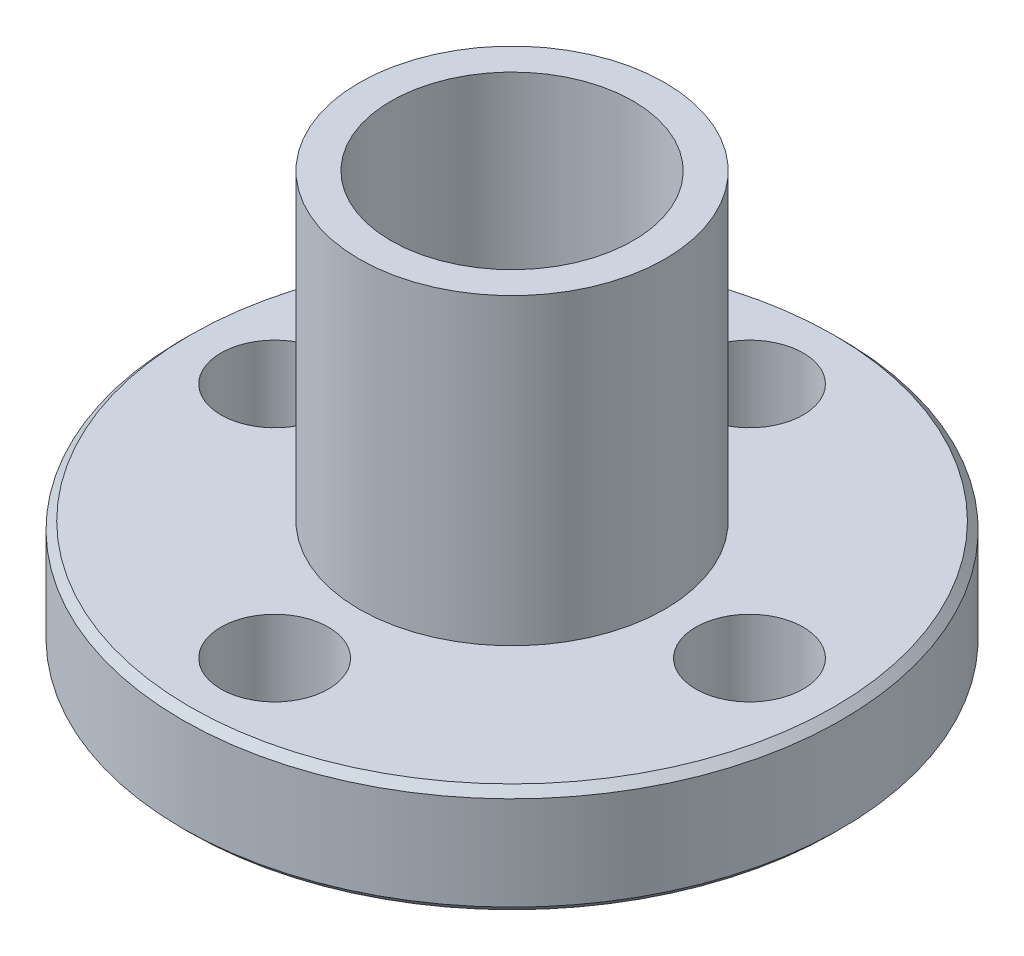
ISO-10303-21;
HEADER;
FILE_DESCRIPTION(('STEP AP214'),'2;1');
FILE_NAME('part.step','',(''),(''),'','','');
FILE_SCHEMA(('AUTOMOTIVE_DESIGN { 1 0 10303 214 1 1 1 1 }'));
ENDSEC;
DATA;
#1=APPLICATION_CONTEXT('core data for automotive mechanical design processes');
#2=APPLICATION_PROTOCOL_DEFINITION('international standard','automotive_design',2000,#1);
#3=PRODUCT_CONTEXT('',#1,'mechanical');
#4=PRODUCT('Part','Part','',(#3));
#5=PRODUCT_RELATED_PRODUCT_CATEGORY('part','',(#4));
#6=PRODUCT_DEFINITION_FORMATION('','',#4);
#7=PRODUCT_DEFINITION_CONTEXT('part definition',#1,'design');
#8=PRODUCT_DEFINITION('design','',#6,#7);
#9=PRODUCT_DEFINITION_SHAPE('','',#8);
#10=(LENGTH_UNIT() NAMED_UNIT(*) SI_UNIT(.MILLI.,.METRE.));
#11=(NAMED_UNIT(*) PLANE_ANGLE_UNIT() SI_UNIT($,.RADIAN.));
#12=(NAMED_UNIT(*) SI_UNIT($,.STERADIAN.) SOLID_ANGLE_UNIT());
#13=UNCERTAINTY_MEASURE_WITH_UNIT(LENGTH_MEASURE(1.E-05),#10,'distance_accuracy_value','');
#14=(GEOMETRIC_REPRESENTATION_CONTEXT(3) GLOBAL_UNCERTAINTY_ASSIGNED_CONTEXT((#13)) GLOBAL_UNIT_ASSIGNED_CONTEXT((#10,
#11,#12)) REPRESENTATION_CONTEXT('',''));
#15=CARTESIAN_POINT('',(0.,0.,0.));
#16=DIRECTION('',(0.,0.,1.));
#17=DIRECTION('',(1.,0.,0.));
#18=AXIS2_PLACEMENT_3D('',#15,#16,#17);
#19=CARTESIAN_POINT('',(0.,-22.2689569799683,0.));
#20=DIRECTION('',(0.,1.,0.));
#21=DIRECTION('',(0.,0.,1.));
#22=AXIS2_PLACEMENT_3D('',#19,#20,#21);
#23=CYLINDRICAL_SURFACE('',#22,4.);
#24=CARTESIAN_POINT('',(0.,-5.7927,0.));
#25=DIRECTION('',(0.,1.,0.));
#26=DIRECTION('',(0.,0.,1.));
#27=AXIS2_PLACEMENT_3D('',#24,#25,#26);
#28=CIRCLE('',#27,4.);
#29=CARTESIAN_POINT('',(0.,-5.7927,4.));
#30=VERTEX_POINT('',#29);
#31=EDGE_CURVE('E57',#30,#30,#28,.F.);
#32=ORIENTED_EDGE('',*,*,#31,.T.);
#33=EDGE_LOOP('',(#32));
#34=FACE_BOUND('',#33,.T.);
#35=CARTESIAN_POINT('',(0.,10.02,0.));
#36=DIRECTION('',(0.,1.,0.));
#37=DIRECTION('',(0.,0.,1.));
#38=AXIS2_PLACEMENT_3D('',#35,#36,#37);
#39=CIRCLE('',#38,4.);
#40=CARTESIAN_POINT('',(0.,10.02,4.));
#41=VERTEX_POINT('',#40);
#42=EDGE_CURVE('E67',#41,#41,#39,.T.);
#43=ORIENTED_EDGE('',*,*,#42,.T.);
#44=EDGE_LOOP('',(#43));
#45=FACE_BOUND('',#44,.T.);
#46=ADVANCED_FACE('F49',(#34,#45),#23,.F.);
#47=CARTESIAN_POINT('',(0.,-22.2689569799683,0.));
#48=DIRECTION('',(0.,1.,0.));
#49=DIRECTION('',(0.,0.,1.));
#50=AXIS2_PLACEMENT_3D('',#47,#48,#49);
#51=CYLINDRICAL_SURFACE('',#50,5.05);
#52=CARTESIAN_POINT('',(0.,-5.7927,0.));
#53=DIRECTION('',(0.,1.,0.));
#54=DIRECTION('',(0.,0.,1.));
#55=AXIS2_PLACEMENT_3D('',#52,#53,#54);
#56=CIRCLE('',#55,5.05);
#57=CARTESIAN_POINT('',(0.,-5.7927,5.05));
#58=VERTEX_POINT('',#57);
#59=EDGE_CURVE('E11',#58,#58,#56,.F.);
#60=ORIENTED_EDGE('',*,*,#59,.F.);
#61=EDGE_LOOP('',(#60));
#62=FACE_BOUND('',#61,.T.);
#63=CARTESIAN_POINT('',(0.,10.02,0.));
#64=DIRECTION('',(0.,1.,0.));
#65=DIRECTION('',(0.,0.,1.));
#66=AXIS2_PLACEMENT_3D('',#63,#64,#65);
#67=CIRCLE('',#66,5.05);
#68=CARTESIAN_POINT('',(0.,10.02,5.05));
#69=VERTEX_POINT('',#68);
#70=EDGE_CURVE('E63',#69,#69,#67,.T.);
#71=ORIENTED_EDGE('',*,*,#70,.F.);
#72=EDGE_LOOP('',(#71));
#73=FACE_BOUND('',#72,.T.);
#74=ADVANCED_FACE('F81',(#62,#73),#51,.T.);
#75=CARTESIAN_POINT('',(0.,-5.7927,0.));
#76=DIRECTION('',(0.,1.,0.));
#77=DIRECTION('',(0.,0.,1.));
#78=AXIS2_PLACEMENT_3D('',#75,#76,#77);
#79=PLANE('',#78);
#80=ORIENTED_EDGE('',*,*,#59,.T.);
#81=EDGE_LOOP('',(#80));
#82=FACE_BOUND('',#81,.T.);
#83=ORIENTED_EDGE('',*,*,#31,.F.);
#84=EDGE_LOOP('',(#83));
#85=FACE_BOUND('',#84,.T.);
#86=ADVANCED_FACE('F51',(#82,#85),#79,.F.);
#87=CARTESIAN_POINT('',(0.,10.02,0.));
#88=DIRECTION('',(0.,1.,0.));
#89=DIRECTION('',(0.,0.,1.));
#90=AXIS2_PLACEMENT_3D('',#87,#88,#89);
#91=PLANE('',#90);
#92=ORIENTED_EDGE('',*,*,#42,.F.);
#93=EDGE_LOOP('',(#92));
#94=FACE_BOUND('',#93,.T.);
#95=ORIENTED_EDGE('',*,*,#70,.T.);
#96=EDGE_LOOP('',(#95));
#97=FACE_BOUND('',#96,.T.);
#98=ADVANCED_FACE('F75',(#94,#97),#91,.T.);
#99=CLOSED_SHELL('',(#46,#74,#86,#98));
#100=MANIFOLD_SOLID_BREP('B2',#99);
#101=CARTESIAN_POINT('',(0.,-3.6,0.));
#102=DIRECTION('',(0.,1.,0.));
#103=DIRECTION('',(0.,0.,1.));
#104=AXIS2_PLACEMENT_3D('',#101,#102,#103);
#105=CYLINDRICAL_SURFACE('',#104,5.05);
#106=CARTESIAN_POINT('',(0.,-3.6,0.));
#107=DIRECTION('',(0.,1.,0.));
#108=DIRECTION('',(0.,0.,1.));
#109=AXIS2_PLACEMENT_3D('',#106,#107,#108);
#110=CIRCLE('',#109,5.05);
#111=CARTESIAN_POINT('',(0.,-3.6,5.05));
#112=VERTEX_POINT('',#111);
#113=EDGE_CURVE('E144',#112,#112,#110,.T.);
#114=ORIENTED_EDGE('',*,*,#113,.F.);
#115=EDGE_LOOP('',(#114));
#116=FACE_BOUND('',#115,.T.);
#117=CARTESIAN_POINT('',(0.,0.,0.));
#118=DIRECTION('',(0.,1.,0.));
#119=DIRECTION('',(0.,0.,1.));
#120=AXIS2_PLACEMENT_3D('',#117,#118,#119);
#121=CIRCLE('',#120,5.05);
#122=CARTESIAN_POINT('',(0.,0.,5.05));
#123=VERTEX_POINT('',#122);
#124=EDGE_CURVE('E145',#123,#123,#121,.T.);
#125=ORIENTED_EDGE('',*,*,#124,.T.);
#126=EDGE_LOOP('',(#125));
#127=FACE_BOUND('',#126,.T.);
#128=ADVANCED_FACE('F118',(#116,#127),#105,.F.);
#129=CARTESIAN_POINT('',(0.,-3.6,-7.84525));
#130=DIRECTION('',(0.,1.,0.));
#131=DIRECTION('',(0.,0.,1.));
#132=AXIS2_PLACEMENT_3D('',#129,#130,#131);
#133=CYLINDRICAL_SURFACE('',#132,1.775);
#134=CARTESIAN_POINT('',(0.,-3.6,-7.84525));
#135=DIRECTION('',(0.,1.,0.));
#136=DIRECTION('',(0.,0.,1.));
#137=AXIS2_PLACEMENT_3D('',#134,#135,#136);
#138=CIRCLE('',#137,1.775);
#139=CARTESIAN_POINT('',(0.,-3.6,-6.07025));
#140=VERTEX_POINT('',#139);
#141=EDGE_CURVE('E168',#140,#140,#138,.T.);
#142=ORIENTED_EDGE('',*,*,#141,.F.);
#143=EDGE_LOOP('',(#142));
#144=FACE_BOUND('',#143,.T.);
#145=CARTESIAN_POINT('',(0.,0.,-7.84525));
#146=DIRECTION('',(0.,1.,0.));
#147=DIRECTION('',(0.,0.,1.));
#148=AXIS2_PLACEMENT_3D('',#145,#146,#147);
#149=CIRCLE('',#148,1.775);
#150=CARTESIAN_POINT('',(0.,0.,-6.07025));
#151=VERTEX_POINT('',#150);
#152=EDGE_CURVE('E150',#151,#151,#149,.T.);
#153=ORIENTED_EDGE('',*,*,#152,.T.);
#154=EDGE_LOOP('',(#153));
#155=FACE_BOUND('',#154,.T.);
#156=ADVANCED_FACE('F209',(#144,#155),#133,.F.);
#157=CARTESIAN_POINT('',(7.84525,-3.6,0.));
#158=DIRECTION('',(0.,1.,0.));
#159=DIRECTION('',(0.,0.,1.));
#160=AXIS2_PLACEMENT_3D('',#157,#158,#159);
#161=CYLINDRICAL_SURFACE('',#160,1.775);
#162=CARTESIAN_POINT('',(7.84525,-3.6,0.));
#163=DIRECTION('',(0.,1.,0.));
#164=DIRECTION('',(0.,0.,1.));
#165=AXIS2_PLACEMENT_3D('',#162,#163,#164);
#166=CIRCLE('',#165,1.775);
#167=CARTESIAN_POINT('',(7.84525,-3.6,1.775));
#168=VERTEX_POINT('',#167);
#169=EDGE_CURVE('E172',#168,#168,#166,.T.);
#170=ORIENTED_EDGE('',*,*,#169,.F.);
#171=EDGE_LOOP('',(#170));
#172=FACE_BOUND('',#171,.T.);
#173=CARTESIAN_POINT('',(7.84525,0.,0.));
#174=DIRECTION('',(0.,1.,0.));
#175=DIRECTION('',(0.,0.,1.));
#176=AXIS2_PLACEMENT_3D('',#173,#174,#175);
#177=CIRCLE('',#176,1.775);
#178=CARTESIAN_POINT('',(7.84525,0.,1.775));
#179=VERTEX_POINT('',#178);
#180=EDGE_CURVE('E154',#179,#179,#177,.T.);
#181=ORIENTED_EDGE('',*,*,#180,.T.);
#182=EDGE_LOOP('',(#181));
#183=FACE_BOUND('',#182,.T.);
#184=ADVANCED_FACE('F215',(#172,#183),#161,.F.);
#185=CARTESIAN_POINT('',(0.,-3.6,7.84525));
#186=DIRECTION('',(0.,1.,0.));
#187=DIRECTION('',(0.,0.,1.));
#188=AXIS2_PLACEMENT_3D('',#185,#186,#187);
#189=CYLINDRICAL_SURFACE('',#188,1.775);
#190=CARTESIAN_POINT('',(0.,-3.6,7.84525));
#191=DIRECTION('',(0.,1.,0.));
#192=DIRECTION('',(0.,0.,1.));
#193=AXIS2_PLACEMENT_3D('',#190,#191,#192);
#194=CIRCLE('',#193,1.775);
#195=CARTESIAN_POINT('',(0.,-3.6,9.62025));
#196=VERTEX_POINT('',#195);
#197=EDGE_CURVE('E176',#196,#196,#194,.T.);
#198=ORIENTED_EDGE('',*,*,#197,.F.);
#199=EDGE_LOOP('',(#198));
#200=FACE_BOUND('',#199,.T.);
#201=CARTESIAN_POINT('',(0.,0.,7.84525));
#202=DIRECTION('',(0.,1.,0.));
#203=DIRECTION('',(0.,0.,1.));
#204=AXIS2_PLACEMENT_3D('',#201,#202,#203);
#205=CIRCLE('',#204,1.775);
#206=CARTESIAN_POINT('',(0.,0.,9.62025));
#207=VERTEX_POINT('',#206);
#208=EDGE_CURVE('E158',#207,#207,#205,.T.);
#209=ORIENTED_EDGE('',*,*,#208,.T.);
#210=EDGE_LOOP('',(#209));
#211=FACE_BOUND('',#210,.T.);
#212=ADVANCED_FACE('F191',(#200,#211),#189,.F.);
#213=CARTESIAN_POINT('',(-7.84525,-3.6,0.));
#214=DIRECTION('',(0.,1.,0.));
#215=DIRECTION('',(0.,0.,1.));
#216=AXIS2_PLACEMENT_3D('',#213,#214,#215);
#217=CYLINDRICAL_SURFACE('',#216,1.775);
#218=CARTESIAN_POINT('',(-7.84525,-3.6,0.));
#219=DIRECTION('',(0.,1.,0.));
#220=DIRECTION('',(0.,0.,1.));
#221=AXIS2_PLACEMENT_3D('',#218,#219,#220);
#222=CIRCLE('',#221,1.775);
#223=CARTESIAN_POINT('',(-7.84525,-3.6,1.775));
#224=VERTEX_POINT('',#223);
#225=EDGE_CURVE('E149',#224,#224,#222,.T.);
#226=ORIENTED_EDGE('',*,*,#225,.F.);
#227=EDGE_LOOP('',(#226));
#228=FACE_BOUND('',#227,.T.);
#229=CARTESIAN_POINT('',(-7.84525,0.,0.));
#230=DIRECTION('',(0.,1.,0.));
#231=DIRECTION('',(0.,0.,1.));
#232=AXIS2_PLACEMENT_3D('',#229,#230,#231);
#233=CIRCLE('',#232,1.775);
#234=CARTESIAN_POINT('',(-7.84525,0.,1.775));
#235=VERTEX_POINT('',#234);
#236=EDGE_CURVE('E161',#235,#235,#233,.T.);
#237=ORIENTED_EDGE('',*,*,#236,.T.);
#238=EDGE_LOOP('',(#237));
#239=FACE_BOUND('',#238,.T.);
#240=ADVANCED_FACE('F187',(#228,#239),#217,.F.);
#241=CARTESIAN_POINT('',(0.,-3.6,0.));
#242=DIRECTION('',(0.,1.,0.));
#243=DIRECTION('',(0.,0.,1.));
#244=AXIS2_PLACEMENT_3D('',#241,#242,#243);
#245=CYLINDRICAL_SURFACE('',#244,10.89025);
#246=CARTESIAN_POINT('',(0.,-3.349999992,0.));
#247=DIRECTION('',(0.,1.,0.));
#248=DIRECTION('',(0.,0.,1.));
#249=AXIS2_PLACEMENT_3D('',#246,#247,#248);
#250=CIRCLE('',#249,10.89025);
#251=CARTESIAN_POINT('',(0.,-3.349999992,10.89025));
#252=VERTEX_POINT('',#251);
#253=EDGE_CURVE('E134',#252,#252,#250,.T.);
#254=ORIENTED_EDGE('',*,*,#253,.T.);
#255=EDGE_LOOP('',(#254));
#256=FACE_BOUND('',#255,.T.);
#257=CARTESIAN_POINT('',(0.,-0.250000007999995,0.));
#258=DIRECTION('',(0.,1.,0.));
#259=DIRECTION('',(0.,0.,1.));
#260=AXIS2_PLACEMENT_3D('',#257,#258,#259);
#261=CIRCLE('',#260,10.89025);
#262=CARTESIAN_POINT('',(0.,-0.250000007999995,10.89025));
#263=VERTEX_POINT('',#262);
#264=EDGE_CURVE('E139',#263,#263,#261,.F.);
#265=ORIENTED_EDGE('',*,*,#264,.T.);
#266=EDGE_LOOP('',(#265));
#267=FACE_BOUND('',#266,.T.);
#268=ADVANCED_FACE('F190',(#256,#267),#245,.T.);
#269=CARTESIAN_POINT('',(0.,-3.6,0.));
#270=DIRECTION('',(0.,1.,0.));
#271=DIRECTION('',(0.,0.,1.));
#272=AXIS2_PLACEMENT_3D('',#269,#270,#271);
#273=PLANE('',#272);
#274=CARTESIAN_POINT('',(0.,-3.6,0.));
#275=DIRECTION('',(0.,1.,0.));
#276=DIRECTION('',(0.,0.,1.));
#277=AXIS2_PLACEMENT_3D('',#274,#275,#276);
#278=CIRCLE('',#277,10.640249992);
#279=CARTESIAN_POINT('',(0.,-3.6,10.640249992));
#280=VERTEX_POINT('',#279);
#281=EDGE_CURVE('E127',#280,#280,#278,.F.);
#282=ORIENTED_EDGE('',*,*,#281,.T.);
#283=EDGE_LOOP('',(#282));
#284=FACE_BOUND('',#283,.T.);
#285=ORIENTED_EDGE('',*,*,#225,.T.);
#286=EDGE_LOOP('',(#285));
#287=FACE_BOUND('',#286,.T.);
#288=ORIENTED_EDGE('',*,*,#197,.T.);
#289=EDGE_LOOP('',(#288));
#290=FACE_BOUND('',#289,.T.);
#291=ORIENTED_EDGE('',*,*,#169,.T.);
#292=EDGE_LOOP('',(#291));
#293=FACE_BOUND('',#292,.T.);
#294=ORIENTED_EDGE('',*,*,#141,.T.);
#295=EDGE_LOOP('',(#294));
#296=FACE_BOUND('',#295,.T.);
#297=ORIENTED_EDGE('',*,*,#113,.T.);
#298=EDGE_LOOP('',(#297));
#299=FACE_BOUND('',#298,.T.);
#300=ADVANCED_FACE('F184',(#284,#287,#290,#293,#296,#299),#273,.F.);
#301=CARTESIAN_POINT('',(0.,0.,0.));
#302=DIRECTION('',(0.,1.,0.));
#303=DIRECTION('',(0.,0.,1.));
#304=AXIS2_PLACEMENT_3D('',#301,#302,#303);
#305=PLANE('',#304);
#306=CARTESIAN_POINT('',(0.,0.,0.));
#307=DIRECTION('',(0.,1.,0.));
#308=DIRECTION('',(0.,0.,1.));
#309=AXIS2_PLACEMENT_3D('',#306,#307,#308);
#310=CIRCLE('',#309,10.640249992);
#311=CARTESIAN_POINT('',(0.,0.,10.640249992));
#312=VERTEX_POINT('',#311);
#313=EDGE_CURVE('E48',#312,#312,#310,.T.);
#314=ORIENTED_EDGE('',*,*,#313,.T.);
#315=EDGE_LOOP('',(#314));
#316=FACE_BOUND('',#315,.T.);
#317=ORIENTED_EDGE('',*,*,#236,.F.);
#318=EDGE_LOOP('',(#317));
#319=FACE_BOUND('',#318,.T.);
#320=ORIENTED_EDGE('',*,*,#208,.F.);
#321=EDGE_LOOP('',(#320));
#322=FACE_BOUND('',#321,.T.);
#323=ORIENTED_EDGE('',*,*,#180,.F.);
#324=EDGE_LOOP('',(#323));
#325=FACE_BOUND('',#324,.T.);
#326=ORIENTED_EDGE('',*,*,#152,.F.);
#327=EDGE_LOOP('',(#326));
#328=FACE_BOUND('',#327,.T.);
#329=ORIENTED_EDGE('',*,*,#124,.F.);
#330=EDGE_LOOP('',(#329));
#331=FACE_BOUND('',#330,.T.);
#332=ADVANCED_FACE('F195',(#316,#319,#322,#325,#328,#331),#305,.T.);
#333=CARTESIAN_POINT('',(0.,-3.349999992,0.));
#334=DIRECTION('',(0.,1.,0.));
#335=DIRECTION('',(0.,0.,1.));
#336=AXIS2_PLACEMENT_3D('',#333,#334,#335);
#337=CONICAL_SURFACE('',#336,10.89025,0.785398163397448);
#338=ORIENTED_EDGE('',*,*,#281,.F.);
#339=EDGE_LOOP('',(#338));
#340=FACE_BOUND('',#339,.T.);
#341=ORIENTED_EDGE('',*,*,#253,.F.);
#342=EDGE_LOOP('',(#341));
#343=FACE_BOUND('',#342,.T.);
#344=ADVANCED_FACE('F198',(#340,#343),#337,.T.);
#345=CARTESIAN_POINT('',(0.,0.,0.));
#346=DIRECTION('',(0.,-1.,0.));
#347=DIRECTION('',(0.,0.,-1.));
#348=AXIS2_PLACEMENT_3D('',#345,#346,#347);
#349=CONICAL_SURFACE('',#348,10.640249992,0.785398163397445);
#350=ORIENTED_EDGE('',*,*,#264,.F.);
#351=EDGE_LOOP('',(#350));
#352=FACE_BOUND('',#351,.T.);
#353=ORIENTED_EDGE('',*,*,#313,.F.);
#354=EDGE_LOOP('',(#353));
#355=FACE_BOUND('',#354,.T.);
#356=ADVANCED_FACE('F121',(#352,#355),#349,.T.);
#357=CLOSED_SHELL('',(#128,#156,#184,#212,#240,#268,#300,#332,#344,#356));
#358=MANIFOLD_SOLID_BREP('B6',#357);
#359=ADVANCED_BREP_SHAPE_REPRESENTATION('',(#18,#100,#358),#14);
#360=SHAPE_DEFINITION_REPRESENTATION(#9,#359);
ENDSEC;
END-ISO-10303-21;
